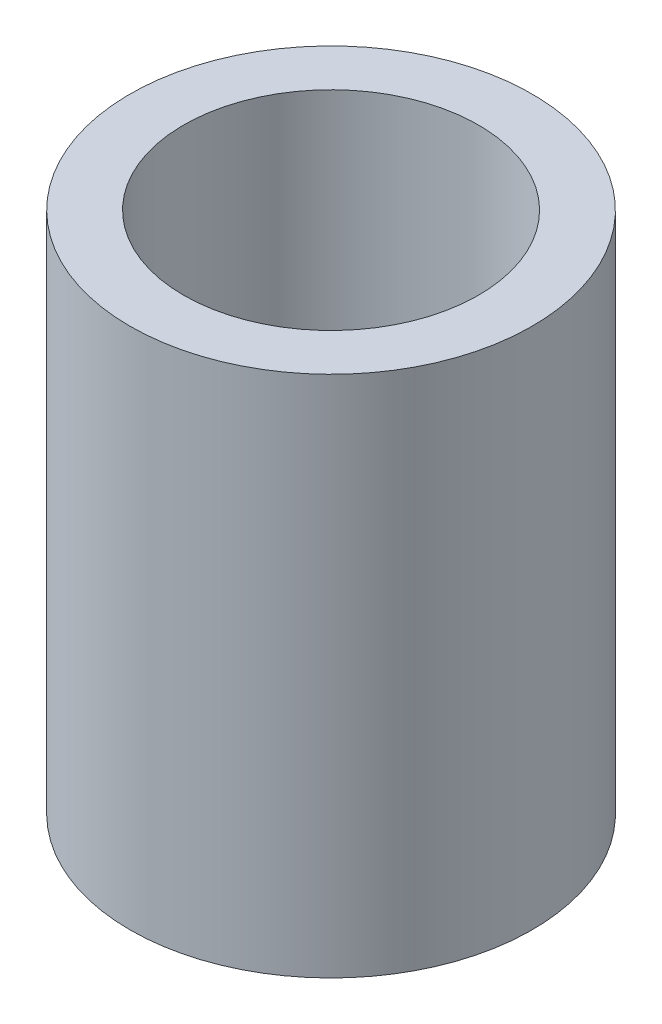
ISO-10303-21;
HEADER;
FILE_DESCRIPTION(('STEP AP214'),'2;1');
FILE_NAME('part.step','',(''),(''),'','','');
FILE_SCHEMA(('AUTOMOTIVE_DESIGN { 1 0 10303 214 1 1 1 1 }'));
ENDSEC;
DATA;
#1=APPLICATION_CONTEXT('core data for automotive mechanical design processes');
#2=APPLICATION_PROTOCOL_DEFINITION('international standard','automotive_design',2000,#1);
#3=PRODUCT_CONTEXT('',#1,'mechanical');
#4=PRODUCT('Part','Part','',(#3));
#5=PRODUCT_RELATED_PRODUCT_CATEGORY('part','',(#4));
#6=PRODUCT_DEFINITION_FORMATION('','',#4);
#7=PRODUCT_DEFINITION_CONTEXT('part definition',#1,'design');
#8=PRODUCT_DEFINITION('design','',#6,#7);
#9=PRODUCT_DEFINITION_SHAPE('','',#8);
#10=(LENGTH_UNIT() NAMED_UNIT(*) SI_UNIT(.MILLI.,.METRE.));
#11=(NAMED_UNIT(*) PLANE_ANGLE_UNIT() SI_UNIT($,.RADIAN.));
#12=(NAMED_UNIT(*) SI_UNIT($,.STERADIAN.) SOLID_ANGLE_UNIT());
#13=UNCERTAINTY_MEASURE_WITH_UNIT(LENGTH_MEASURE(1.E-05),#10,'distance_accuracy_value','');
#14=(GEOMETRIC_REPRESENTATION_CONTEXT(3) GLOBAL_UNCERTAINTY_ASSIGNED_CONTEXT((#13)) GLOBAL_UNIT_ASSIGNED_CONTEXT((#10,
#11,#12)) REPRESENTATION_CONTEXT('',''));
#15=CARTESIAN_POINT('',(0.,0.,0.));
#16=DIRECTION('',(0.,0.,1.));
#17=DIRECTION('',(1.,0.,0.));
#18=AXIS2_PLACEMENT_3D('',#15,#16,#17);
#19=CARTESIAN_POINT('',(0.,19.5,0.));
#20=DIRECTION('',(0.,1.,0.));
#21=DIRECTION('',(0.,0.,1.));
#22=AXIS2_PLACEMENT_3D('',#19,#20,#21);
#23=PLANE('',#22);
#24=CARTESIAN_POINT('',(0.,19.5,0.));
#25=DIRECTION('',(0.,1.,0.));
#26=DIRECTION('',(0.,0.,1.));
#27=AXIS2_PLACEMENT_3D('',#24,#25,#26);
#28=CIRCLE('',#27,7.5);
#29=CARTESIAN_POINT('',(0.,19.5,7.5));
#30=VERTEX_POINT('',#29);
#31=EDGE_CURVE('E10',#30,#30,#28,.T.);
#32=ORIENTED_EDGE('',*,*,#31,.T.);
#33=EDGE_LOOP('',(#32));
#34=FACE_BOUND('',#33,.T.);
#35=CARTESIAN_POINT('',(0.,19.5,0.));
#36=DIRECTION('',(0.,1.,0.));
#37=DIRECTION('',(0.,0.,1.));
#38=AXIS2_PLACEMENT_3D('',#35,#36,#37);
#39=CIRCLE('',#38,5.5);
#40=CARTESIAN_POINT('',(0.,19.5,5.5));
#41=VERTEX_POINT('',#40);
#42=EDGE_CURVE('E42',#41,#41,#39,.T.);
#43=ORIENTED_EDGE('',*,*,#42,.F.);
#44=EDGE_LOOP('',(#43));
#45=FACE_BOUND('',#44,.T.);
#46=ADVANCED_FACE('F31',(#34,#45),#23,.T.);
#47=CARTESIAN_POINT('',(0.,0.,0.));
#48=DIRECTION('',(0.,1.,0.));
#49=DIRECTION('',(0.,0.,1.));
#50=AXIS2_PLACEMENT_3D('',#47,#48,#49);
#51=PLANE('',#50);
#52=CARTESIAN_POINT('',(0.,0.,0.));
#53=DIRECTION('',(0.,1.,0.));
#54=DIRECTION('',(0.,0.,1.));
#55=AXIS2_PLACEMENT_3D('',#52,#53,#54);
#56=CIRCLE('',#55,7.5);
#57=CARTESIAN_POINT('',(0.,0.,7.5));
#58=VERTEX_POINT('',#57);
#59=EDGE_CURVE('E35',#58,#58,#56,.T.);
#60=ORIENTED_EDGE('',*,*,#59,.F.);
#61=EDGE_LOOP('',(#60));
#62=FACE_BOUND('',#61,.T.);
#63=CARTESIAN_POINT('',(0.,0.,0.));
#64=DIRECTION('',(0.,1.,0.));
#65=DIRECTION('',(0.,0.,1.));
#66=AXIS2_PLACEMENT_3D('',#63,#64,#65);
#67=CIRCLE('',#66,5.5);
#68=CARTESIAN_POINT('',(0.,0.,5.5));
#69=VERTEX_POINT('',#68);
#70=EDGE_CURVE('E44',#69,#69,#67,.T.);
#71=ORIENTED_EDGE('',*,*,#70,.T.);
#72=EDGE_LOOP('',(#71));
#73=FACE_BOUND('',#72,.T.);
#74=ADVANCED_FACE('F54',(#62,#73),#51,.F.);
#75=CARTESIAN_POINT('',(0.,19.5,0.));
#76=DIRECTION('',(0.,-1.,0.));
#77=DIRECTION('',(0.,0.,-1.));
#78=AXIS2_PLACEMENT_3D('',#75,#76,#77);
#79=CYLINDRICAL_SURFACE('',#78,7.5);
#80=ORIENTED_EDGE('',*,*,#31,.F.);
#81=EDGE_LOOP('',(#80));
#82=FACE_BOUND('',#81,.T.);
#83=ORIENTED_EDGE('',*,*,#59,.T.);
#84=EDGE_LOOP('',(#83));
#85=FACE_BOUND('',#84,.T.);
#86=ADVANCED_FACE('F33',(#82,#85),#79,.T.);
#87=CARTESIAN_POINT('',(0.,19.5,0.));
#88=DIRECTION('',(0.,-1.,0.));
#89=DIRECTION('',(0.,0.,-1.));
#90=AXIS2_PLACEMENT_3D('',#87,#88,#89);
#91=CYLINDRICAL_SURFACE('',#90,5.5);
#92=ORIENTED_EDGE('',*,*,#42,.T.);
#93=EDGE_LOOP('',(#92));
#94=FACE_BOUND('',#93,.T.);
#95=ORIENTED_EDGE('',*,*,#70,.F.);
#96=EDGE_LOOP('',(#95));
#97=FACE_BOUND('',#96,.T.);
#98=ADVANCED_FACE('F50',(#94,#97),#91,.F.);
#99=CLOSED_SHELL('',(#46,#74,#86,#98));
#100=MANIFOLD_SOLID_BREP('B2',#99);
#101=ADVANCED_BREP_SHAPE_REPRESENTATION('',(#18,#100),#14);
#102=SHAPE_DEFINITION_REPRESENTATION(#9,#101);
ENDSEC;
END-ISO-10303-21;
